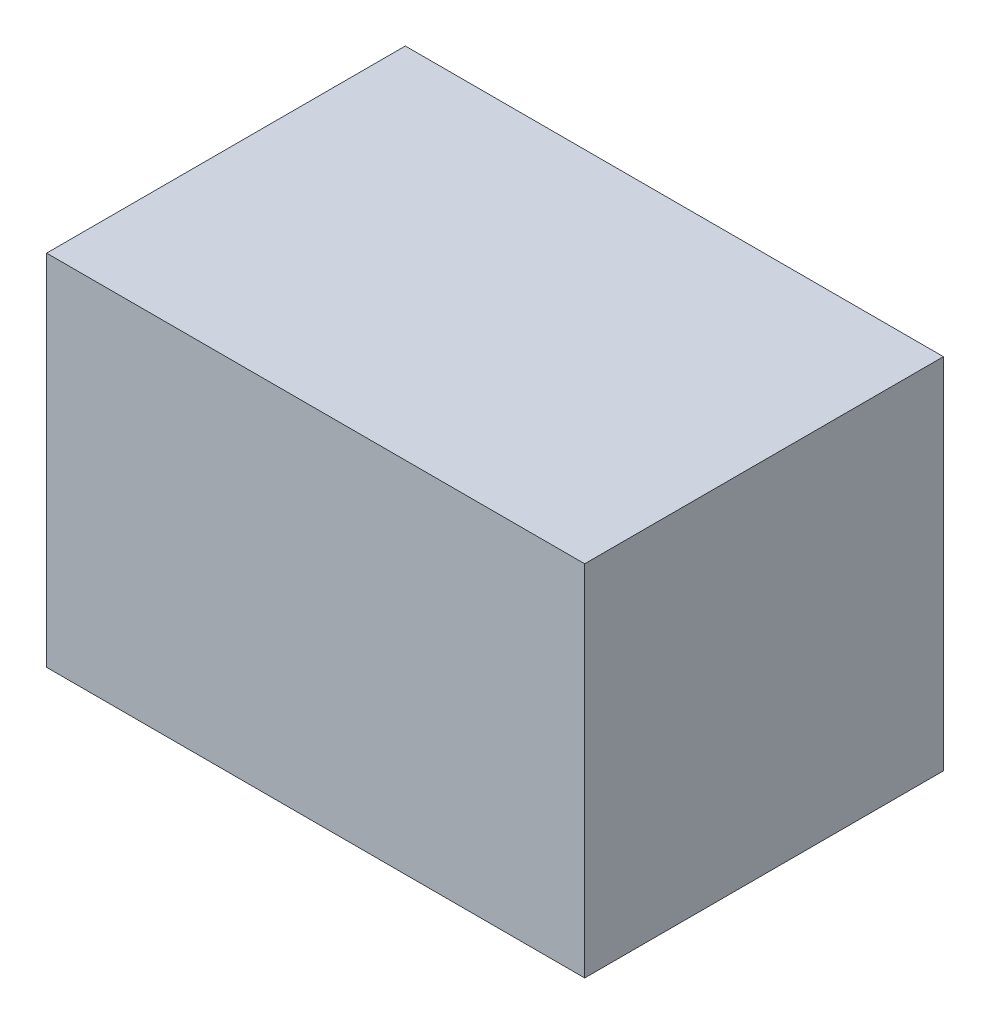
ISO-10303-21;
HEADER;
FILE_DESCRIPTION(('STEP AP214'),'2;1');
FILE_NAME('part.step','',(''),(''),'','','');
FILE_SCHEMA(('AUTOMOTIVE_DESIGN { 1 0 10303 214 1 1 1 1 }'));
ENDSEC;
DATA;
#1=APPLICATION_CONTEXT('core data for automotive mechanical design processes');
#2=APPLICATION_PROTOCOL_DEFINITION('international standard','automotive_design',2000,#1);
#3=PRODUCT_CONTEXT('',#1,'mechanical');
#4=PRODUCT('Part','Part','',(#3));
#5=PRODUCT_RELATED_PRODUCT_CATEGORY('part','',(#4));
#6=PRODUCT_DEFINITION_FORMATION('','',#4);
#7=PRODUCT_DEFINITION_CONTEXT('part definition',#1,'design');
#8=PRODUCT_DEFINITION('design','',#6,#7);
#9=PRODUCT_DEFINITION_SHAPE('','',#8);
#10=(LENGTH_UNIT() NAMED_UNIT(*) SI_UNIT(.MILLI.,.METRE.));
#11=(NAMED_UNIT(*) PLANE_ANGLE_UNIT() SI_UNIT($,.RADIAN.));
#12=(NAMED_UNIT(*) SI_UNIT($,.STERADIAN.) SOLID_ANGLE_UNIT());
#13=UNCERTAINTY_MEASURE_WITH_UNIT(LENGTH_MEASURE(1.E-05),#10,'distance_accuracy_value','');
#14=(GEOMETRIC_REPRESENTATION_CONTEXT(3) GLOBAL_UNCERTAINTY_ASSIGNED_CONTEXT((#13)) GLOBAL_UNIT_ASSIGNED_CONTEXT((#10,
#11,#12)) REPRESENTATION_CONTEXT('',''));
#15=CARTESIAN_POINT('',(0.,0.,0.));
#16=DIRECTION('',(0.,0.,1.));
#17=DIRECTION('',(1.,0.,0.));
#18=AXIS2_PLACEMENT_3D('',#15,#16,#17);
#19=CARTESIAN_POINT('',(228.6,304.8,152.4));
#20=DIRECTION('',(-1.,0.,0.));
#21=DIRECTION('',(0.,0.,1.));
#22=AXIS2_PLACEMENT_3D('',#19,#20,#21);
#23=PLANE('',#22);
#24=DIRECTION('',(0.,0.,-1.));
#25=VECTOR('',#24,1.);
#26=CARTESIAN_POINT('',(228.6,0.,152.4));
#27=LINE('',#26,#25);
#28=CARTESIAN_POINT('',(228.6,0.,152.4));
#29=VERTEX_POINT('',#28);
#30=CARTESIAN_POINT('',(228.6,0.,-152.4));
#31=VERTEX_POINT('',#30);
#32=EDGE_CURVE('E100',#29,#31,#27,.T.);
#33=ORIENTED_EDGE('',*,*,#32,.T.);
#34=DIRECTION('',(0.,-1.,0.));
#35=VECTOR('',#34,1.);
#36=CARTESIAN_POINT('',(228.6,304.8,-152.4));
#37=LINE('',#36,#35);
#38=CARTESIAN_POINT('',(228.6,304.8,-152.4));
#39=VERTEX_POINT('',#38);
#40=EDGE_CURVE('E11',#39,#31,#37,.T.);
#41=ORIENTED_EDGE('',*,*,#40,.F.);
#42=DIRECTION('',(0.,0.,-1.));
#43=VECTOR('',#42,1.);
#44=CARTESIAN_POINT('',(228.6,304.8,152.4));
#45=LINE('',#44,#43);
#46=CARTESIAN_POINT('',(228.6,304.8,152.4));
#47=VERTEX_POINT('',#46);
#48=EDGE_CURVE('E88',#47,#39,#45,.T.);
#49=ORIENTED_EDGE('',*,*,#48,.F.);
#50=DIRECTION('',(0.,-1.,0.));
#51=VECTOR('',#50,1.);
#52=CARTESIAN_POINT('',(228.6,304.8,152.4));
#53=LINE('',#52,#51);
#54=EDGE_CURVE('E96',#47,#29,#53,.T.);
#55=ORIENTED_EDGE('',*,*,#54,.T.);
#56=EDGE_LOOP('',(#33,#41,#49,#55));
#57=FACE_BOUND('',#56,.T.);
#58=ADVANCED_FACE('F37',(#57),#23,.F.);
#59=CARTESIAN_POINT('',(-228.6,304.8,-152.4));
#60=DIRECTION('',(0.,0.,1.));
#61=DIRECTION('',(1.,0.,0.));
#62=AXIS2_PLACEMENT_3D('',#59,#60,#61);
#63=PLANE('',#62);
#64=DIRECTION('',(-1.,0.,0.));
#65=VECTOR('',#64,1.);
#66=CARTESIAN_POINT('',(-228.6,0.,-152.4));
#67=LINE('',#66,#65);
#68=CARTESIAN_POINT('',(-228.6,0.,-152.4));
#69=VERTEX_POINT('',#68);
#70=EDGE_CURVE('E92',#31,#69,#67,.T.);
#71=ORIENTED_EDGE('',*,*,#70,.T.);
#72=DIRECTION('',(0.,-1.,0.));
#73=VECTOR('',#72,1.);
#74=CARTESIAN_POINT('',(-228.6,304.8,-152.4));
#75=LINE('',#74,#73);
#76=CARTESIAN_POINT('',(-228.6,304.8,-152.4));
#77=VERTEX_POINT('',#76);
#78=EDGE_CURVE('E45',#77,#69,#75,.T.);
#79=ORIENTED_EDGE('',*,*,#78,.F.);
#80=DIRECTION('',(-1.,0.,0.));
#81=VECTOR('',#80,1.);
#82=CARTESIAN_POINT('',(-228.6,304.8,-152.4));
#83=LINE('',#82,#81);
#84=EDGE_CURVE('E83',#39,#77,#83,.T.);
#85=ORIENTED_EDGE('',*,*,#84,.F.);
#86=ORIENTED_EDGE('',*,*,#40,.T.);
#87=EDGE_LOOP('',(#71,#79,#85,#86));
#88=FACE_BOUND('',#87,.T.);
#89=ADVANCED_FACE('F91',(#88),#63,.F.);
#90=CARTESIAN_POINT('',(-228.6,304.8,152.4));
#91=DIRECTION('',(1.,0.,0.));
#92=DIRECTION('',(0.,0.,-1.));
#93=AXIS2_PLACEMENT_3D('',#90,#91,#92);
#94=PLANE('',#93);
#95=DIRECTION('',(0.,0.,1.));
#96=VECTOR('',#95,1.);
#97=CARTESIAN_POINT('',(-228.6,0.,152.4));
#98=LINE('',#97,#96);
#99=CARTESIAN_POINT('',(-228.6,0.,152.4));
#100=VERTEX_POINT('',#99);
#101=EDGE_CURVE('E70',#69,#100,#98,.T.);
#102=ORIENTED_EDGE('',*,*,#101,.T.);
#103=DIRECTION('',(0.,-1.,0.));
#104=VECTOR('',#103,1.);
#105=CARTESIAN_POINT('',(-228.6,304.8,152.4));
#106=LINE('',#105,#104);
#107=CARTESIAN_POINT('',(-228.6,304.8,152.4));
#108=VERTEX_POINT('',#107);
#109=EDGE_CURVE('E93',#108,#100,#106,.T.);
#110=ORIENTED_EDGE('',*,*,#109,.F.);
#111=DIRECTION('',(0.,0.,1.));
#112=VECTOR('',#111,1.);
#113=CARTESIAN_POINT('',(-228.6,304.8,152.4));
#114=LINE('',#113,#112);
#115=EDGE_CURVE('E86',#77,#108,#114,.T.);
#116=ORIENTED_EDGE('',*,*,#115,.F.);
#117=ORIENTED_EDGE('',*,*,#78,.T.);
#118=EDGE_LOOP('',(#102,#110,#116,#117));
#119=FACE_BOUND('',#118,.T.);
#120=ADVANCED_FACE('F94',(#119),#94,.F.);
#121=CARTESIAN_POINT('',(-228.6,304.8,152.4));
#122=DIRECTION('',(0.,0.,-1.));
#123=DIRECTION('',(-1.,0.,0.));
#124=AXIS2_PLACEMENT_3D('',#121,#122,#123);
#125=PLANE('',#124);
#126=DIRECTION('',(1.,0.,0.));
#127=VECTOR('',#126,1.);
#128=CARTESIAN_POINT('',(-228.6,0.,152.4));
#129=LINE('',#128,#127);
#130=EDGE_CURVE('E76',#100,#29,#129,.T.);
#131=ORIENTED_EDGE('',*,*,#130,.T.);
#132=ORIENTED_EDGE('',*,*,#54,.F.);
#133=DIRECTION('',(1.,0.,0.));
#134=VECTOR('',#133,1.);
#135=CARTESIAN_POINT('',(-228.6,304.8,152.4));
#136=LINE('',#135,#134);
#137=EDGE_CURVE('E53',#108,#47,#136,.T.);
#138=ORIENTED_EDGE('',*,*,#137,.F.);
#139=ORIENTED_EDGE('',*,*,#109,.T.);
#140=EDGE_LOOP('',(#131,#132,#138,#139));
#141=FACE_BOUND('',#140,.T.);
#142=ADVANCED_FACE('F107',(#141),#125,.F.);
#143=CARTESIAN_POINT('',(0.,304.8,0.));
#144=DIRECTION('',(0.,-1.,0.));
#145=DIRECTION('',(0.,0.,-1.));
#146=AXIS2_PLACEMENT_3D('',#143,#144,#145);
#147=PLANE('',#146);
#148=ORIENTED_EDGE('',*,*,#48,.T.);
#149=ORIENTED_EDGE('',*,*,#84,.T.);
#150=ORIENTED_EDGE('',*,*,#115,.T.);
#151=ORIENTED_EDGE('',*,*,#137,.T.);
#152=EDGE_LOOP('',(#148,#149,#150,#151));
#153=FACE_BOUND('',#152,.T.);
#154=ADVANCED_FACE('F84',(#153),#147,.F.);
#155=CARTESIAN_POINT('',(0.,0.,0.));
#156=DIRECTION('',(0.,-1.,0.));
#157=DIRECTION('',(0.,0.,-1.));
#158=AXIS2_PLACEMENT_3D('',#155,#156,#157);
#159=PLANE('',#158);
#160=ORIENTED_EDGE('',*,*,#32,.F.);
#161=ORIENTED_EDGE('',*,*,#130,.F.);
#162=ORIENTED_EDGE('',*,*,#101,.F.);
#163=ORIENTED_EDGE('',*,*,#70,.F.);
#164=EDGE_LOOP('',(#160,#161,#162,#163));
#165=FACE_BOUND('',#164,.T.);
#166=ADVANCED_FACE('F110',(#165),#159,.T.);
#167=CLOSED_SHELL('',(#58,#89,#120,#142,#154,#166));
#168=MANIFOLD_SOLID_BREP('B2',#167);
#169=ADVANCED_BREP_SHAPE_REPRESENTATION('',(#18,#168),#14);
#170=SHAPE_DEFINITION_REPRESENTATION(#9,#169);
ENDSEC;
END-ISO-10303-21;
